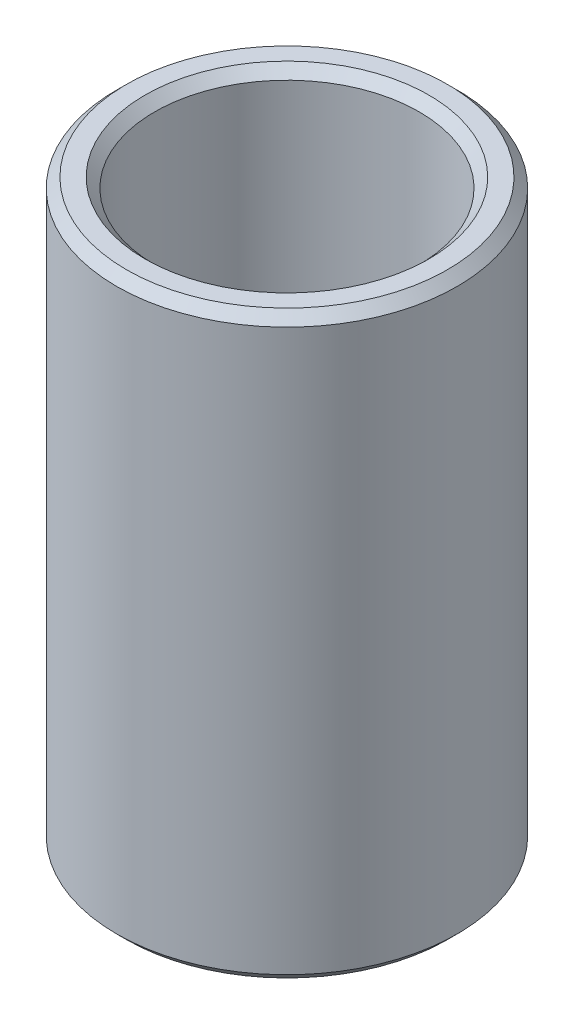
ISO-10303-21;
HEADER;
FILE_DESCRIPTION(('STEP AP214'),'2;1');
FILE_NAME('part.step','',(''),(''),'','','');
FILE_SCHEMA(('AUTOMOTIVE_DESIGN { 1 0 10303 214 1 1 1 1 }'));
ENDSEC;
DATA;
#1=APPLICATION_CONTEXT('core data for automotive mechanical design processes');
#2=APPLICATION_PROTOCOL_DEFINITION('international standard','automotive_design',2000,#1);
#3=PRODUCT_CONTEXT('',#1,'mechanical');
#4=PRODUCT('Part','Part','',(#3));
#5=PRODUCT_RELATED_PRODUCT_CATEGORY('part','',(#4));
#6=PRODUCT_DEFINITION_FORMATION('','',#4);
#7=PRODUCT_DEFINITION_CONTEXT('part definition',#1,'design');
#8=PRODUCT_DEFINITION('design','',#6,#7);
#9=PRODUCT_DEFINITION_SHAPE('','',#8);
#10=(LENGTH_UNIT() NAMED_UNIT(*) SI_UNIT(.MILLI.,.METRE.));
#11=(NAMED_UNIT(*) PLANE_ANGLE_UNIT() SI_UNIT($,.RADIAN.));
#12=(NAMED_UNIT(*) SI_UNIT($,.STERADIAN.) SOLID_ANGLE_UNIT());
#13=UNCERTAINTY_MEASURE_WITH_UNIT(LENGTH_MEASURE(1.E-05),#10,'distance_accuracy_value','');
#14=(GEOMETRIC_REPRESENTATION_CONTEXT(3) GLOBAL_UNCERTAINTY_ASSIGNED_CONTEXT((#13)) GLOBAL_UNIT_ASSIGNED_CONTEXT((#10,
#11,#12)) REPRESENTATION_CONTEXT('',''));
#15=CARTESIAN_POINT('',(0.,0.,0.));
#16=DIRECTION('',(0.,0.,1.));
#17=DIRECTION('',(1.,0.,0.));
#18=AXIS2_PLACEMENT_3D('',#15,#16,#17);
#19=CARTESIAN_POINT('',(0.,102.239954512971,0.));
#20=DIRECTION('',(0.,-1.,0.));
#21=DIRECTION('',(0.,0.,-1.));
#22=AXIS2_PLACEMENT_3D('',#19,#20,#21);
#23=CYLINDRICAL_SURFACE('',#22,30.);
#24=CARTESIAN_POINT('',(0.,1.70644078885061,0.));
#25=DIRECTION('',(0.,1.,0.));
#26=DIRECTION('',(0.,0.,1.));
#27=AXIS2_PLACEMENT_3D('',#24,#25,#26);
#28=CIRCLE('',#27,30.);
#29=CARTESIAN_POINT('',(0.,1.70644078885061,30.));
#30=VERTEX_POINT('',#29);
#31=EDGE_CURVE('E10',#30,#30,#28,.T.);
#32=ORIENTED_EDGE('',*,*,#31,.T.);
#33=EDGE_LOOP('',(#32));
#34=FACE_BOUND('',#33,.T.);
#35=CARTESIAN_POINT('',(0.,100.53351372412,0.));
#36=DIRECTION('',(0.,1.,0.));
#37=DIRECTION('',(0.,0.,1.));
#38=AXIS2_PLACEMENT_3D('',#35,#36,#37);
#39=CIRCLE('',#38,30.);
#40=CARTESIAN_POINT('',(0.,100.53351372412,30.));
#41=VERTEX_POINT('',#40);
#42=EDGE_CURVE('E50',#41,#41,#39,.F.);
#43=ORIENTED_EDGE('',*,*,#42,.T.);
#44=EDGE_LOOP('',(#43));
#45=FACE_BOUND('',#44,.T.);
#46=ADVANCED_FACE('F39',(#34,#45),#23,.T.);
#47=CARTESIAN_POINT('',(0.,102.239954512971,0.));
#48=DIRECTION('',(0.,1.,0.));
#49=DIRECTION('',(0.,0.,1.));
#50=AXIS2_PLACEMENT_3D('',#47,#48,#49);
#51=PLANE('',#50);
#52=CARTESIAN_POINT('',(0.,102.239954512971,0.));
#53=DIRECTION('',(0.,1.,0.));
#54=DIRECTION('',(0.,0.,1.));
#55=AXIS2_PLACEMENT_3D('',#52,#53,#54);
#56=CIRCLE('',#55,25.021741841163);
#57=CARTESIAN_POINT('',(0.,102.239954512971,25.021741841163));
#58=VERTEX_POINT('',#57);
#59=EDGE_CURVE('E58',#58,#58,#56,.F.);
#60=ORIENTED_EDGE('',*,*,#59,.T.);
#61=EDGE_LOOP('',(#60));
#62=FACE_BOUND('',#61,.T.);
#63=CARTESIAN_POINT('',(0.,102.239954512971,0.));
#64=DIRECTION('',(0.,1.,0.));
#65=DIRECTION('',(0.,0.,1.));
#66=AXIS2_PLACEMENT_3D('',#63,#64,#65);
#67=CIRCLE('',#66,28.2935592111494);
#68=CARTESIAN_POINT('',(0.,102.239954512971,28.2935592111494));
#69=VERTEX_POINT('',#68);
#70=EDGE_CURVE('E61',#69,#69,#67,.T.);
#71=ORIENTED_EDGE('',*,*,#70,.T.);
#72=EDGE_LOOP('',(#71));
#73=FACE_BOUND('',#72,.T.);
#74=ADVANCED_FACE('F88',(#62,#73),#51,.T.);
#75=CARTESIAN_POINT('',(0.,0.,0.));
#76=DIRECTION('',(0.,1.,0.));
#77=DIRECTION('',(0.,0.,1.));
#78=AXIS2_PLACEMENT_3D('',#75,#76,#77);
#79=PLANE('',#78);
#80=CARTESIAN_POINT('',(0.,0.,0.));
#81=DIRECTION('',(0.,1.,0.));
#82=DIRECTION('',(0.,0.,1.));
#83=AXIS2_PLACEMENT_3D('',#80,#81,#82);
#84=CIRCLE('',#83,25.021741841163);
#85=CARTESIAN_POINT('',(0.,0.,25.021741841163));
#86=VERTEX_POINT('',#85);
#87=EDGE_CURVE('E51',#86,#86,#84,.T.);
#88=ORIENTED_EDGE('',*,*,#87,.T.);
#89=EDGE_LOOP('',(#88));
#90=FACE_BOUND('',#89,.T.);
#91=CARTESIAN_POINT('',(0.,0.,0.));
#92=DIRECTION('',(0.,1.,0.));
#93=DIRECTION('',(0.,0.,1.));
#94=AXIS2_PLACEMENT_3D('',#91,#92,#93);
#95=CIRCLE('',#94,28.2935592111494);
#96=CARTESIAN_POINT('',(0.,0.,28.2935592111494));
#97=VERTEX_POINT('',#96);
#98=EDGE_CURVE('E54',#97,#97,#95,.F.);
#99=ORIENTED_EDGE('',*,*,#98,.T.);
#100=EDGE_LOOP('',(#99));
#101=FACE_BOUND('',#100,.T.);
#102=ADVANCED_FACE('F83',(#90,#101),#79,.F.);
#103=CARTESIAN_POINT('',(0.,102.239954512971,0.));
#104=DIRECTION('',(0.,-1.,0.));
#105=DIRECTION('',(0.,0.,-1.));
#106=AXIS2_PLACEMENT_3D('',#103,#104,#105);
#107=CYLINDRICAL_SURFACE('',#106,23.3153010523123);
#108=CARTESIAN_POINT('',(0.,100.53351372412,0.));
#109=DIRECTION('',(0.,1.,0.));
#110=DIRECTION('',(0.,0.,1.));
#111=AXIS2_PLACEMENT_3D('',#108,#109,#110);
#112=CIRCLE('',#111,23.3153010523123);
#113=CARTESIAN_POINT('',(0.,100.53351372412,23.3153010523123));
#114=VERTEX_POINT('',#113);
#115=EDGE_CURVE('E67',#114,#114,#112,.T.);
#116=ORIENTED_EDGE('',*,*,#115,.T.);
#117=EDGE_LOOP('',(#116));
#118=FACE_BOUND('',#117,.T.);
#119=CARTESIAN_POINT('',(0.,1.70644078885061,0.));
#120=DIRECTION('',(0.,1.,0.));
#121=DIRECTION('',(0.,0.,1.));
#122=AXIS2_PLACEMENT_3D('',#119,#120,#121);
#123=CIRCLE('',#122,23.3153010523123);
#124=CARTESIAN_POINT('',(0.,1.70644078885061,23.3153010523123));
#125=VERTEX_POINT('',#124);
#126=EDGE_CURVE('E69',#125,#125,#123,.F.);
#127=ORIENTED_EDGE('',*,*,#126,.T.);
#128=EDGE_LOOP('',(#127));
#129=FACE_BOUND('',#128,.T.);
#130=ADVANCED_FACE('F71',(#118,#129),#107,.F.);
#131=CARTESIAN_POINT('',(0.,100.53351372412,0.));
#132=DIRECTION('',(0.,1.,0.));
#133=DIRECTION('',(0.,0.,1.));
#134=AXIS2_PLACEMENT_3D('',#131,#132,#133);
#135=CONICAL_SURFACE('',#134,23.3153010523123,0.785398163397449);
#136=ORIENTED_EDGE('',*,*,#59,.F.);
#137=EDGE_LOOP('',(#136));
#138=FACE_BOUND('',#137,.T.);
#139=ORIENTED_EDGE('',*,*,#115,.F.);
#140=EDGE_LOOP('',(#139));
#141=FACE_BOUND('',#140,.T.);
#142=ADVANCED_FACE('F77',(#138,#141),#135,.F.);
#143=CARTESIAN_POINT('',(0.,0.,0.));
#144=DIRECTION('',(0.,-1.,0.));
#145=DIRECTION('',(0.,0.,-1.));
#146=AXIS2_PLACEMENT_3D('',#143,#144,#145);
#147=CONICAL_SURFACE('',#146,25.021741841163,0.785398163397448);
#148=ORIENTED_EDGE('',*,*,#126,.F.);
#149=EDGE_LOOP('',(#148));
#150=FACE_BOUND('',#149,.T.);
#151=ORIENTED_EDGE('',*,*,#87,.F.);
#152=EDGE_LOOP('',(#151));
#153=FACE_BOUND('',#152,.T.);
#154=ADVANCED_FACE('F73',(#150,#153),#147,.F.);
#155=CARTESIAN_POINT('',(0.,1.70644078885061,0.));
#156=DIRECTION('',(0.,1.,0.));
#157=DIRECTION('',(0.,0.,1.));
#158=AXIS2_PLACEMENT_3D('',#155,#156,#157);
#159=CONICAL_SURFACE('',#158,30.,0.785398163397452);
#160=ORIENTED_EDGE('',*,*,#98,.F.);
#161=EDGE_LOOP('',(#160));
#162=FACE_BOUND('',#161,.T.);
#163=ORIENTED_EDGE('',*,*,#31,.F.);
#164=EDGE_LOOP('',(#163));
#165=FACE_BOUND('',#164,.T.);
#166=ADVANCED_FACE('F76',(#162,#165),#159,.T.);
#167=CARTESIAN_POINT('',(0.,102.239954512971,0.));
#168=DIRECTION('',(0.,-1.,0.));
#169=DIRECTION('',(0.,0.,-1.));
#170=AXIS2_PLACEMENT_3D('',#167,#168,#169);
#171=CONICAL_SURFACE('',#170,28.2935592111494,0.78539816339744);
#172=ORIENTED_EDGE('',*,*,#42,.F.);
#173=EDGE_LOOP('',(#172));
#174=FACE_BOUND('',#173,.T.);
#175=ORIENTED_EDGE('',*,*,#70,.F.);
#176=EDGE_LOOP('',(#175));
#177=FACE_BOUND('',#176,.T.);
#178=ADVANCED_FACE('F45',(#174,#177),#171,.T.);
#179=CLOSED_SHELL('',(#46,#74,#102,#130,#142,#154,#166,#178));
#180=MANIFOLD_SOLID_BREP('B2',#179);
#181=ADVANCED_BREP_SHAPE_REPRESENTATION('',(#18,#180),#14);
#182=SHAPE_DEFINITION_REPRESENTATION(#9,#181);
ENDSEC;
END-ISO-10303-21;
